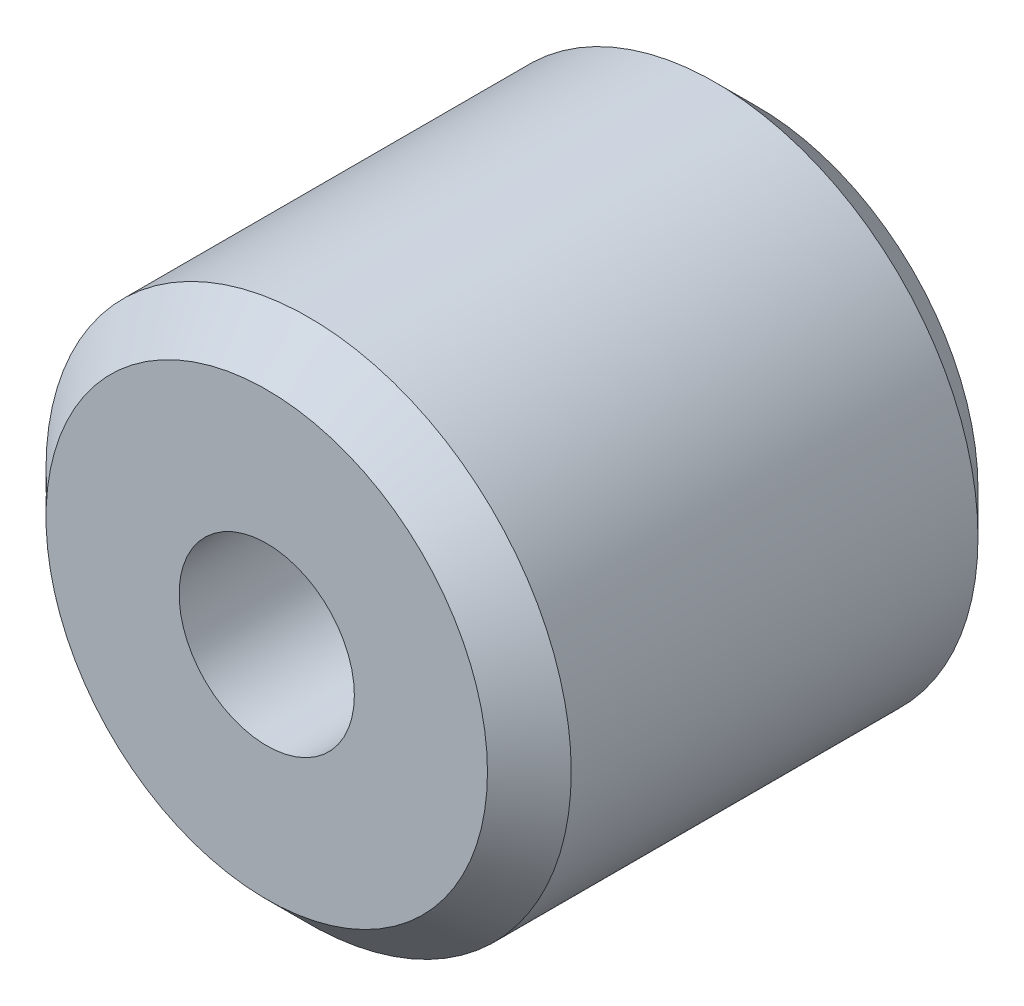
ISO-10303-21;
HEADER;
FILE_DESCRIPTION(('STEP AP214'),'2;1');
FILE_NAME('part.step','',(''),(''),'','','');
FILE_SCHEMA(('AUTOMOTIVE_DESIGN { 1 0 10303 214 1 1 1 1 }'));
ENDSEC;
DATA;
#1=APPLICATION_CONTEXT('core data for automotive mechanical design processes');
#2=APPLICATION_PROTOCOL_DEFINITION('international standard','automotive_design',2000,#1);
#3=PRODUCT_CONTEXT('',#1,'mechanical');
#4=PRODUCT('Part','Part','',(#3));
#5=PRODUCT_RELATED_PRODUCT_CATEGORY('part','',(#4));
#6=PRODUCT_DEFINITION_FORMATION('','',#4);
#7=PRODUCT_DEFINITION_CONTEXT('part definition',#1,'design');
#8=PRODUCT_DEFINITION('design','',#6,#7);
#9=PRODUCT_DEFINITION_SHAPE('','',#8);
#10=(LENGTH_UNIT() NAMED_UNIT(*) SI_UNIT(.MILLI.,.METRE.));
#11=(NAMED_UNIT(*) PLANE_ANGLE_UNIT() SI_UNIT($,.RADIAN.));
#12=(NAMED_UNIT(*) SI_UNIT($,.STERADIAN.) SOLID_ANGLE_UNIT());
#13=UNCERTAINTY_MEASURE_WITH_UNIT(LENGTH_MEASURE(1.E-05),#10,'distance_accuracy_value','');
#14=(GEOMETRIC_REPRESENTATION_CONTEXT(3) GLOBAL_UNCERTAINTY_ASSIGNED_CONTEXT((#13)) GLOBAL_UNIT_ASSIGNED_CONTEXT((#10,
#11,#12)) REPRESENTATION_CONTEXT('',''));
#15=CARTESIAN_POINT('',(0.,0.,0.));
#16=DIRECTION('',(0.,0.,1.));
#17=DIRECTION('',(1.,0.,0.));
#18=AXIS2_PLACEMENT_3D('',#15,#16,#17);
#19=CARTESIAN_POINT('',(0.,0.,4.45));
#20=DIRECTION('',(0.,0.,1.));
#21=DIRECTION('',(1.,0.,0.));
#22=AXIS2_PLACEMENT_3D('',#19,#20,#21);
#23=PLANE('',#22);
#24=CARTESIAN_POINT('',(0.,0.,4.45));
#25=DIRECTION('',(0.,0.,1.));
#26=DIRECTION('',(1.,0.,0.));
#27=AXIS2_PLACEMENT_3D('',#24,#25,#26);
#28=CIRCLE('',#27,4.005);
#29=CARTESIAN_POINT('',(4.005,0.,4.45));
#30=VERTEX_POINT('',#29);
#31=EDGE_CURVE('E10',#30,#30,#28,.T.);
#32=ORIENTED_EDGE('',*,*,#31,.T.);
#33=EDGE_LOOP('',(#32));
#34=FACE_BOUND('',#33,.T.);
#35=CARTESIAN_POINT('',(0.,0.,4.45));
#36=DIRECTION('',(0.,0.,1.));
#37=DIRECTION('',(1.,0.,0.));
#38=AXIS2_PLACEMENT_3D('',#35,#36,#37);
#39=CIRCLE('',#38,1.59);
#40=CARTESIAN_POINT('',(1.59,0.,4.45));
#41=VERTEX_POINT('',#40);
#42=EDGE_CURVE('E70',#41,#41,#39,.T.);
#43=ORIENTED_EDGE('',*,*,#42,.F.);
#44=EDGE_LOOP('',(#43));
#45=FACE_BOUND('',#44,.T.);
#46=ADVANCED_FACE('F45',(#34,#45),#23,.T.);
#47=CARTESIAN_POINT('',(0.,0.,-4.45));
#48=DIRECTION('',(0.,0.,1.));
#49=DIRECTION('',(1.,0.,0.));
#50=AXIS2_PLACEMENT_3D('',#47,#48,#49);
#51=PLANE('',#50);
#52=CARTESIAN_POINT('',(0.,0.,-4.45));
#53=DIRECTION('',(0.,0.,1.));
#54=DIRECTION('',(1.,0.,0.));
#55=AXIS2_PLACEMENT_3D('',#52,#53,#54);
#56=CIRCLE('',#55,4.00499999999999);
#57=CARTESIAN_POINT('',(4.00499999999999,0.,-4.45));
#58=VERTEX_POINT('',#57);
#59=EDGE_CURVE('E54',#58,#58,#56,.F.);
#60=ORIENTED_EDGE('',*,*,#59,.T.);
#61=EDGE_LOOP('',(#60));
#62=FACE_BOUND('',#61,.T.);
#63=CARTESIAN_POINT('',(0.,0.,-4.45));
#64=DIRECTION('',(0.,0.,1.));
#65=DIRECTION('',(1.,0.,0.));
#66=AXIS2_PLACEMENT_3D('',#63,#64,#65);
#67=CIRCLE('',#66,1.59);
#68=CARTESIAN_POINT('',(1.59,0.,-4.45));
#69=VERTEX_POINT('',#68);
#70=EDGE_CURVE('E71',#69,#69,#67,.T.);
#71=ORIENTED_EDGE('',*,*,#70,.T.);
#72=EDGE_LOOP('',(#71));
#73=FACE_BOUND('',#72,.T.);
#74=ADVANCED_FACE('F83',(#62,#73),#51,.F.);
#75=CARTESIAN_POINT('',(0.,0.,4.45));
#76=DIRECTION('',(0.,0.,-1.));
#77=DIRECTION('',(-1.,0.,0.));
#78=AXIS2_PLACEMENT_3D('',#75,#76,#77);
#79=CYLINDRICAL_SURFACE('',#78,4.765);
#80=CARTESIAN_POINT('',(0.,0.,-3.69));
#81=DIRECTION('',(0.,0.,1.));
#82=DIRECTION('',(1.,0.,0.));
#83=AXIS2_PLACEMENT_3D('',#80,#81,#82);
#84=CIRCLE('',#83,4.765);
#85=CARTESIAN_POINT('',(4.765,0.,-3.69));
#86=VERTEX_POINT('',#85);
#87=EDGE_CURVE('E59',#86,#86,#84,.T.);
#88=ORIENTED_EDGE('',*,*,#87,.T.);
#89=EDGE_LOOP('',(#88));
#90=FACE_BOUND('',#89,.T.);
#91=CARTESIAN_POINT('',(0.,0.,3.69));
#92=DIRECTION('',(0.,0.,1.));
#93=DIRECTION('',(1.,0.,0.));
#94=AXIS2_PLACEMENT_3D('',#91,#92,#93);
#95=CIRCLE('',#94,4.765);
#96=CARTESIAN_POINT('',(4.765,0.,3.69));
#97=VERTEX_POINT('',#96);
#98=EDGE_CURVE('E64',#97,#97,#95,.F.);
#99=ORIENTED_EDGE('',*,*,#98,.T.);
#100=EDGE_LOOP('',(#99));
#101=FACE_BOUND('',#100,.T.);
#102=ADVANCED_FACE('F89',(#90,#101),#79,.T.);
#103=CARTESIAN_POINT('',(0.,0.,4.45));
#104=DIRECTION('',(0.,0.,-1.));
#105=DIRECTION('',(-1.,0.,0.));
#106=AXIS2_PLACEMENT_3D('',#103,#104,#105);
#107=CYLINDRICAL_SURFACE('',#106,1.59);
#108=ORIENTED_EDGE('',*,*,#42,.T.);
#109=EDGE_LOOP('',(#108));
#110=FACE_BOUND('',#109,.T.);
#111=ORIENTED_EDGE('',*,*,#70,.F.);
#112=EDGE_LOOP('',(#111));
#113=FACE_BOUND('',#112,.T.);
#114=ADVANCED_FACE('F79',(#110,#113),#107,.F.);
#115=CARTESIAN_POINT('',(0.,0.,-3.69));
#116=DIRECTION('',(0.,0.,1.));
#117=DIRECTION('',(1.,0.,0.));
#118=AXIS2_PLACEMENT_3D('',#115,#116,#117);
#119=CONICAL_SURFACE('',#118,4.765,0.78539816339745);
#120=ORIENTED_EDGE('',*,*,#59,.F.);
#121=EDGE_LOOP('',(#120));
#122=FACE_BOUND('',#121,.T.);
#123=ORIENTED_EDGE('',*,*,#87,.F.);
#124=EDGE_LOOP('',(#123));
#125=FACE_BOUND('',#124,.T.);
#126=ADVANCED_FACE('F96',(#122,#125),#119,.T.);
#127=CARTESIAN_POINT('',(0.,0.,4.45));
#128=DIRECTION('',(0.,0.,-1.));
#129=DIRECTION('',(-1.,0.,0.));
#130=AXIS2_PLACEMENT_3D('',#127,#128,#129);
#131=CONICAL_SURFACE('',#130,4.005,0.785398163397447);
#132=ORIENTED_EDGE('',*,*,#98,.F.);
#133=EDGE_LOOP('',(#132));
#134=FACE_BOUND('',#133,.T.);
#135=ORIENTED_EDGE('',*,*,#31,.F.);
#136=EDGE_LOOP('',(#135));
#137=FACE_BOUND('',#136,.T.);
#138=ADVANCED_FACE('F48',(#134,#137),#131,.T.);
#139=CLOSED_SHELL('',(#46,#74,#102,#114,#126,#138));
#140=MANIFOLD_SOLID_BREP('B2',#139);
#141=ADVANCED_BREP_SHAPE_REPRESENTATION('',(#18,#140),#14);
#142=SHAPE_DEFINITION_REPRESENTATION(#9,#141);
ENDSEC;
END-ISO-10303-21;
